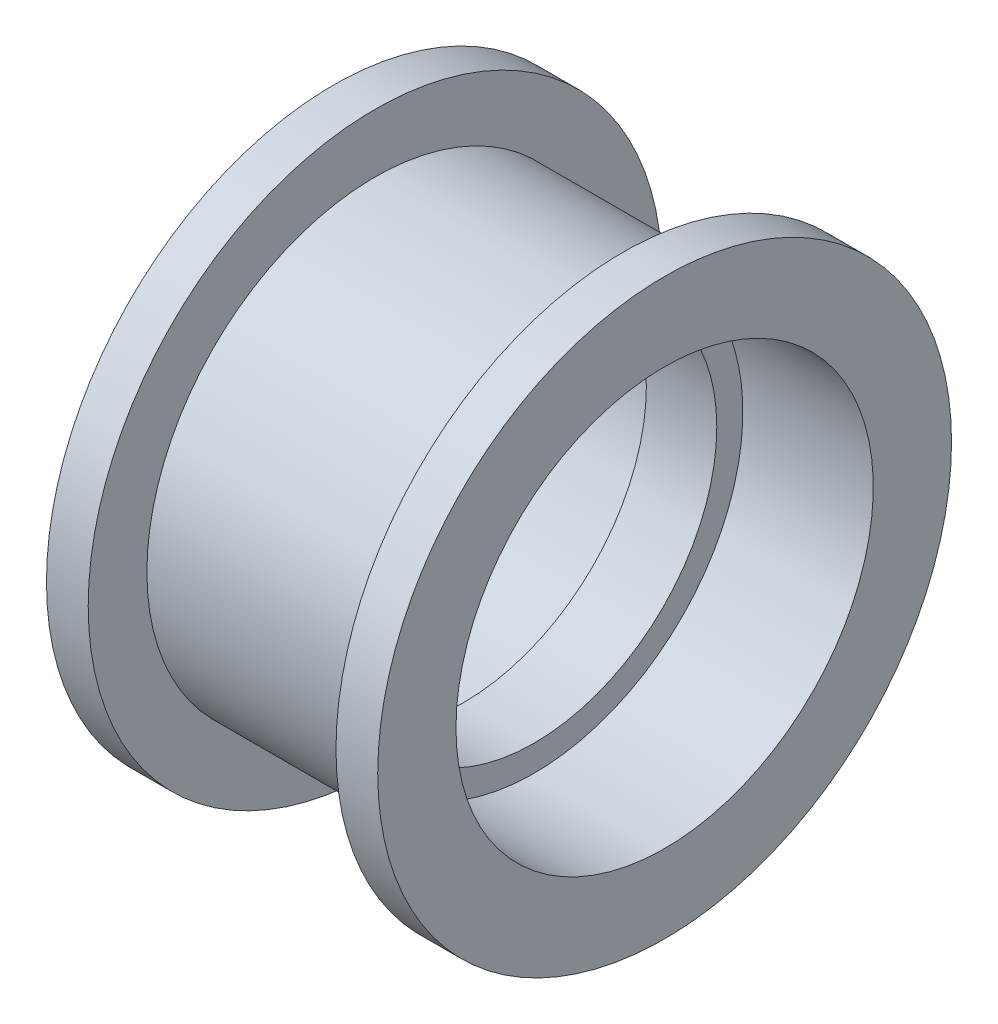
ISO-10303-21;
HEADER;
FILE_DESCRIPTION(('STEP AP214'),'2;1');
FILE_NAME('part.step','',(''),(''),'','','');
FILE_SCHEMA(('AUTOMOTIVE_DESIGN { 1 0 10303 214 1 1 1 1 }'));
ENDSEC;
DATA;
#1=APPLICATION_CONTEXT('core data for automotive mechanical design processes');
#2=APPLICATION_PROTOCOL_DEFINITION('international standard','automotive_design',2000,#1);
#3=PRODUCT_CONTEXT('',#1,'mechanical');
#4=PRODUCT('Part','Part','',(#3));
#5=PRODUCT_RELATED_PRODUCT_CATEGORY('part','',(#4));
#6=PRODUCT_DEFINITION_FORMATION('','',#4);
#7=PRODUCT_DEFINITION_CONTEXT('part definition',#1,'design');
#8=PRODUCT_DEFINITION('design','',#6,#7);
#9=PRODUCT_DEFINITION_SHAPE('','',#8);
#10=(LENGTH_UNIT() NAMED_UNIT(*) SI_UNIT(.MILLI.,.METRE.));
#11=(NAMED_UNIT(*) PLANE_ANGLE_UNIT() SI_UNIT($,.RADIAN.));
#12=(NAMED_UNIT(*) SI_UNIT($,.STERADIAN.) SOLID_ANGLE_UNIT());
#13=UNCERTAINTY_MEASURE_WITH_UNIT(LENGTH_MEASURE(1.E-05),#10,'distance_accuracy_value','');
#14=(GEOMETRIC_REPRESENTATION_CONTEXT(3) GLOBAL_UNCERTAINTY_ASSIGNED_CONTEXT((#13)) GLOBAL_UNIT_ASSIGNED_CONTEXT((#10,
#11,#12)) REPRESENTATION_CONTEXT('',''));
#15=CARTESIAN_POINT('',(0.,0.,0.));
#16=DIRECTION('',(0.,0.,1.));
#17=DIRECTION('',(1.,0.,0.));
#18=AXIS2_PLACEMENT_3D('',#15,#16,#17);
#19=CARTESIAN_POINT('',(-21.5355555555556,0.,0.));
#20=DIRECTION('',(-1.,0.,0.));
#21=DIRECTION('',(0.,0.,1.));
#22=AXIS2_PLACEMENT_3D('',#19,#20,#21);
#23=CYLINDRICAL_SURFACE('',#22,11.);
#24=CARTESIAN_POINT('',(-6.35,0.,0.));
#25=DIRECTION('',(-1.,0.,0.));
#26=DIRECTION('',(0.,0.,1.));
#27=AXIS2_PLACEMENT_3D('',#24,#25,#26);
#28=CIRCLE('',#27,11.);
#29=CARTESIAN_POINT('',(-6.35,0.,11.));
#30=VERTEX_POINT('',#29);
#31=EDGE_CURVE('E9',#30,#30,#28,.T.);
#32=ORIENTED_EDGE('',*,*,#31,.F.);
#33=EDGE_LOOP('',(#32));
#34=FACE_BOUND('',#33,.T.);
#35=CARTESIAN_POINT('',(-4.75,0.,0.));
#36=DIRECTION('',(-1.,0.,0.));
#37=DIRECTION('',(0.,0.,1.));
#38=AXIS2_PLACEMENT_3D('',#35,#36,#37);
#39=CIRCLE('',#38,11.);
#40=CARTESIAN_POINT('',(-4.75,0.,11.));
#41=VERTEX_POINT('',#40);
#42=EDGE_CURVE('E54',#41,#41,#39,.T.);
#43=ORIENTED_EDGE('',*,*,#42,.T.);
#44=EDGE_LOOP('',(#43));
#45=FACE_BOUND('',#44,.T.);
#46=ADVANCED_FACE('F14',(#34,#45),#23,.T.);
#47=CARTESIAN_POINT('',(-6.35,11.,0.));
#48=DIRECTION('',(1.,0.,0.));
#49=DIRECTION('',(0.,0.,-1.));
#50=AXIS2_PLACEMENT_3D('',#47,#48,#49);
#51=PLANE('',#50);
#52=CARTESIAN_POINT('',(-6.35,0.,0.));
#53=DIRECTION('',(-1.,0.,0.));
#54=DIRECTION('',(0.,0.,1.));
#55=AXIS2_PLACEMENT_3D('',#52,#53,#54);
#56=CIRCLE('',#55,8.);
#57=CARTESIAN_POINT('',(-6.35,0.,8.));
#58=VERTEX_POINT('',#57);
#59=EDGE_CURVE('E20',#58,#58,#56,.T.);
#60=ORIENTED_EDGE('',*,*,#59,.F.);
#61=EDGE_LOOP('',(#60));
#62=FACE_BOUND('',#61,.T.);
#63=ORIENTED_EDGE('',*,*,#31,.T.);
#64=EDGE_LOOP('',(#63));
#65=FACE_BOUND('',#64,.T.);
#66=ADVANCED_FACE('F115',(#62,#65),#51,.F.);
#67=CARTESIAN_POINT('',(-21.5355555555556,0.,0.));
#68=DIRECTION('',(-1.,0.,0.));
#69=DIRECTION('',(0.,0.,1.));
#70=AXIS2_PLACEMENT_3D('',#67,#68,#69);
#71=CYLINDRICAL_SURFACE('',#70,8.);
#72=CARTESIAN_POINT('',(-1.35,0.,0.));
#73=DIRECTION('',(-1.,0.,0.));
#74=DIRECTION('',(0.,0.,1.));
#75=AXIS2_PLACEMENT_3D('',#72,#73,#74);
#76=CIRCLE('',#75,8.);
#77=CARTESIAN_POINT('',(-1.35,0.,8.));
#78=VERTEX_POINT('',#77);
#79=EDGE_CURVE('E24',#78,#78,#76,.T.);
#80=ORIENTED_EDGE('',*,*,#79,.F.);
#81=EDGE_LOOP('',(#80));
#82=FACE_BOUND('',#81,.T.);
#83=ORIENTED_EDGE('',*,*,#59,.T.);
#84=EDGE_LOOP('',(#83));
#85=FACE_BOUND('',#84,.T.);
#86=ADVANCED_FACE('F110',(#82,#85),#71,.F.);
#87=CARTESIAN_POINT('',(-1.35,8.,0.));
#88=DIRECTION('',(1.,0.,0.));
#89=DIRECTION('',(0.,0.,-1.));
#90=AXIS2_PLACEMENT_3D('',#87,#88,#89);
#91=PLANE('',#90);
#92=CARTESIAN_POINT('',(-1.35,0.,0.));
#93=DIRECTION('',(-1.,0.,0.));
#94=DIRECTION('',(0.,0.,1.));
#95=AXIS2_PLACEMENT_3D('',#92,#93,#94);
#96=CIRCLE('',#95,7.);
#97=CARTESIAN_POINT('',(-1.35,0.,7.));
#98=VERTEX_POINT('',#97);
#99=EDGE_CURVE('E28',#98,#98,#96,.T.);
#100=ORIENTED_EDGE('',*,*,#99,.F.);
#101=EDGE_LOOP('',(#100));
#102=FACE_BOUND('',#101,.T.);
#103=ORIENTED_EDGE('',*,*,#79,.T.);
#104=EDGE_LOOP('',(#103));
#105=FACE_BOUND('',#104,.T.);
#106=ADVANCED_FACE('F104',(#102,#105),#91,.F.);
#107=CARTESIAN_POINT('',(-21.5355555555556,0.,0.));
#108=DIRECTION('',(-1.,0.,0.));
#109=DIRECTION('',(0.,0.,1.));
#110=AXIS2_PLACEMENT_3D('',#107,#108,#109);
#111=CYLINDRICAL_SURFACE('',#110,7.);
#112=CARTESIAN_POINT('',(1.35,0.,0.));
#113=DIRECTION('',(-1.,0.,0.));
#114=DIRECTION('',(0.,0.,1.));
#115=AXIS2_PLACEMENT_3D('',#112,#113,#114);
#116=CIRCLE('',#115,7.);
#117=CARTESIAN_POINT('',(1.35,0.,7.));
#118=VERTEX_POINT('',#117);
#119=EDGE_CURVE('E33',#118,#118,#116,.T.);
#120=ORIENTED_EDGE('',*,*,#119,.F.);
#121=EDGE_LOOP('',(#120));
#122=FACE_BOUND('',#121,.T.);
#123=ORIENTED_EDGE('',*,*,#99,.T.);
#124=EDGE_LOOP('',(#123));
#125=FACE_BOUND('',#124,.T.);
#126=ADVANCED_FACE('F98',(#122,#125),#111,.F.);
#127=CARTESIAN_POINT('',(1.35,7.,0.));
#128=DIRECTION('',(-1.,0.,0.));
#129=DIRECTION('',(0.,0.,1.));
#130=AXIS2_PLACEMENT_3D('',#127,#128,#129);
#131=PLANE('',#130);
#132=CARTESIAN_POINT('',(1.35,0.,0.));
#133=DIRECTION('',(-1.,0.,0.));
#134=DIRECTION('',(0.,0.,1.));
#135=AXIS2_PLACEMENT_3D('',#132,#133,#134);
#136=CIRCLE('',#135,8.);
#137=CARTESIAN_POINT('',(1.35,0.,8.));
#138=VERTEX_POINT('',#137);
#139=EDGE_CURVE('E36',#138,#138,#136,.T.);
#140=ORIENTED_EDGE('',*,*,#139,.F.);
#141=EDGE_LOOP('',(#140));
#142=FACE_BOUND('',#141,.T.);
#143=ORIENTED_EDGE('',*,*,#119,.T.);
#144=EDGE_LOOP('',(#143));
#145=FACE_BOUND('',#144,.T.);
#146=ADVANCED_FACE('F92',(#142,#145),#131,.F.);
#147=CARTESIAN_POINT('',(-21.5355555555556,0.,0.));
#148=DIRECTION('',(-1.,0.,0.));
#149=DIRECTION('',(0.,0.,1.));
#150=AXIS2_PLACEMENT_3D('',#147,#148,#149);
#151=CYLINDRICAL_SURFACE('',#150,8.);
#152=CARTESIAN_POINT('',(6.35,0.,0.));
#153=DIRECTION('',(-1.,0.,0.));
#154=DIRECTION('',(0.,0.,1.));
#155=AXIS2_PLACEMENT_3D('',#152,#153,#154);
#156=CIRCLE('',#155,8.);
#157=CARTESIAN_POINT('',(6.35,0.,8.));
#158=VERTEX_POINT('',#157);
#159=EDGE_CURVE('E39',#158,#158,#156,.T.);
#160=ORIENTED_EDGE('',*,*,#159,.F.);
#161=EDGE_LOOP('',(#160));
#162=FACE_BOUND('',#161,.T.);
#163=ORIENTED_EDGE('',*,*,#139,.T.);
#164=EDGE_LOOP('',(#163));
#165=FACE_BOUND('',#164,.T.);
#166=ADVANCED_FACE('F86',(#162,#165),#151,.F.);
#167=CARTESIAN_POINT('',(6.35,8.,0.));
#168=DIRECTION('',(-1.,0.,0.));
#169=DIRECTION('',(0.,0.,1.));
#170=AXIS2_PLACEMENT_3D('',#167,#168,#169);
#171=PLANE('',#170);
#172=CARTESIAN_POINT('',(6.35,0.,0.));
#173=DIRECTION('',(-1.,0.,0.));
#174=DIRECTION('',(0.,0.,1.));
#175=AXIS2_PLACEMENT_3D('',#172,#173,#174);
#176=CIRCLE('',#175,11.);
#177=CARTESIAN_POINT('',(6.35,0.,11.));
#178=VERTEX_POINT('',#177);
#179=EDGE_CURVE('E42',#178,#178,#176,.T.);
#180=ORIENTED_EDGE('',*,*,#179,.F.);
#181=EDGE_LOOP('',(#180));
#182=FACE_BOUND('',#181,.T.);
#183=ORIENTED_EDGE('',*,*,#159,.T.);
#184=EDGE_LOOP('',(#183));
#185=FACE_BOUND('',#184,.T.);
#186=ADVANCED_FACE('F80',(#182,#185),#171,.F.);
#187=CARTESIAN_POINT('',(-21.5355555555556,0.,0.));
#188=DIRECTION('',(-1.,0.,0.));
#189=DIRECTION('',(0.,0.,1.));
#190=AXIS2_PLACEMENT_3D('',#187,#188,#189);
#191=CYLINDRICAL_SURFACE('',#190,11.);
#192=CARTESIAN_POINT('',(4.75,0.,0.));
#193=DIRECTION('',(-1.,0.,0.));
#194=DIRECTION('',(0.,0.,1.));
#195=AXIS2_PLACEMENT_3D('',#192,#193,#194);
#196=CIRCLE('',#195,11.);
#197=CARTESIAN_POINT('',(4.75,0.,11.));
#198=VERTEX_POINT('',#197);
#199=EDGE_CURVE('E45',#198,#198,#196,.T.);
#200=ORIENTED_EDGE('',*,*,#199,.F.);
#201=EDGE_LOOP('',(#200));
#202=FACE_BOUND('',#201,.T.);
#203=ORIENTED_EDGE('',*,*,#179,.T.);
#204=EDGE_LOOP('',(#203));
#205=FACE_BOUND('',#204,.T.);
#206=ADVANCED_FACE('F74',(#202,#205),#191,.T.);
#207=CARTESIAN_POINT('',(4.75,11.,0.));
#208=DIRECTION('',(1.,0.,0.));
#209=DIRECTION('',(0.,0.,-1.));
#210=AXIS2_PLACEMENT_3D('',#207,#208,#209);
#211=PLANE('',#210);
#212=CARTESIAN_POINT('',(4.75,0.,0.));
#213=DIRECTION('',(-1.,0.,0.));
#214=DIRECTION('',(0.,0.,1.));
#215=AXIS2_PLACEMENT_3D('',#212,#213,#214);
#216=CIRCLE('',#215,8.75);
#217=CARTESIAN_POINT('',(4.75,0.,8.75));
#218=VERTEX_POINT('',#217);
#219=EDGE_CURVE('E48',#218,#218,#216,.T.);
#220=ORIENTED_EDGE('',*,*,#219,.F.);
#221=EDGE_LOOP('',(#220));
#222=FACE_BOUND('',#221,.T.);
#223=ORIENTED_EDGE('',*,*,#199,.T.);
#224=EDGE_LOOP('',(#223));
#225=FACE_BOUND('',#224,.T.);
#226=ADVANCED_FACE('F68',(#222,#225),#211,.F.);
#227=CARTESIAN_POINT('',(-21.5355555555556,0.,0.));
#228=DIRECTION('',(-1.,0.,0.));
#229=DIRECTION('',(0.,0.,1.));
#230=AXIS2_PLACEMENT_3D('',#227,#228,#229);
#231=CYLINDRICAL_SURFACE('',#230,8.75);
#232=CARTESIAN_POINT('',(-4.75,0.,0.));
#233=DIRECTION('',(-1.,0.,0.));
#234=DIRECTION('',(0.,0.,1.));
#235=AXIS2_PLACEMENT_3D('',#232,#233,#234);
#236=CIRCLE('',#235,8.75);
#237=CARTESIAN_POINT('',(-4.75,0.,8.75));
#238=VERTEX_POINT('',#237);
#239=EDGE_CURVE('E51',#238,#238,#236,.T.);
#240=ORIENTED_EDGE('',*,*,#239,.F.);
#241=EDGE_LOOP('',(#240));
#242=FACE_BOUND('',#241,.T.);
#243=ORIENTED_EDGE('',*,*,#219,.T.);
#244=EDGE_LOOP('',(#243));
#245=FACE_BOUND('',#244,.T.);
#246=ADVANCED_FACE('F62',(#242,#245),#231,.T.);
#247=CARTESIAN_POINT('',(-4.75,8.75,0.));
#248=DIRECTION('',(-1.,0.,0.));
#249=DIRECTION('',(0.,0.,1.));
#250=AXIS2_PLACEMENT_3D('',#247,#248,#249);
#251=PLANE('',#250);
#252=ORIENTED_EDGE('',*,*,#42,.F.);
#253=EDGE_LOOP('',(#252));
#254=FACE_BOUND('',#253,.T.);
#255=ORIENTED_EDGE('',*,*,#239,.T.);
#256=EDGE_LOOP('',(#255));
#257=FACE_BOUND('',#256,.T.);
#258=ADVANCED_FACE('F59',(#254,#257),#251,.F.);
#259=CLOSED_SHELL('',(#46,#66,#86,#106,#126,#146,#166,#186,#206,#226,#246,#258));
#260=MANIFOLD_SOLID_BREP('B1',#259);
#261=ADVANCED_BREP_SHAPE_REPRESENTATION('',(#18,#260),#14);
#262=SHAPE_DEFINITION_REPRESENTATION(#9,#261);
ENDSEC;
END-ISO-10303-21;
